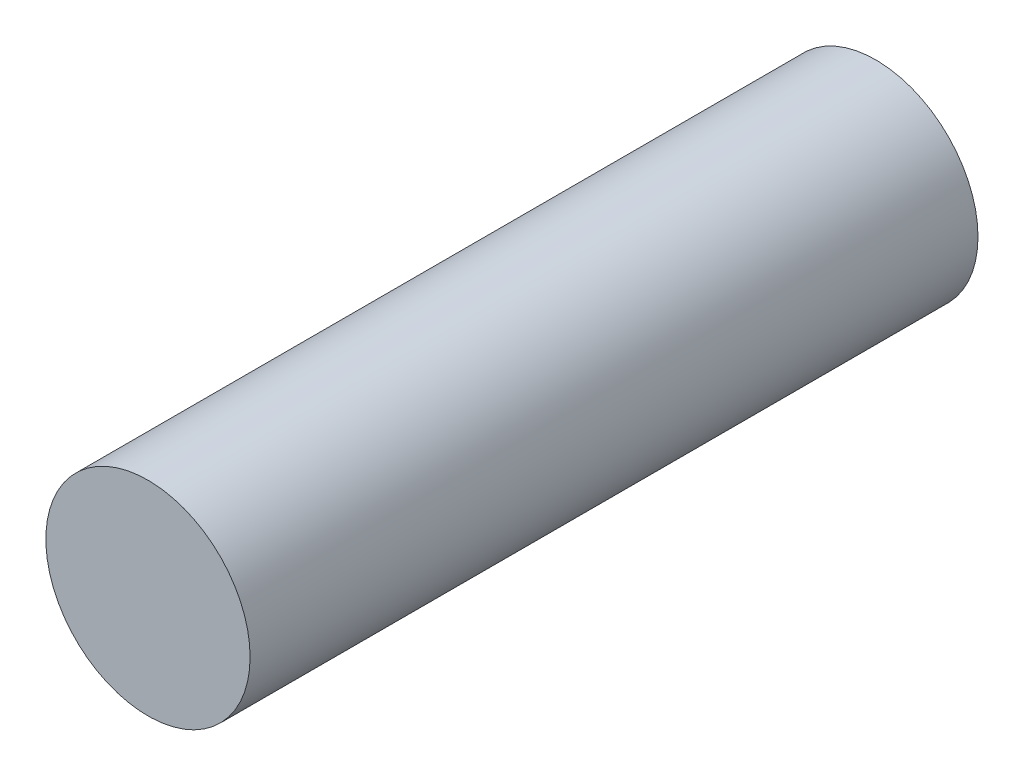
ISO-10303-21;
HEADER;
FILE_DESCRIPTION(('STEP AP214'),'2;1');
FILE_NAME('part.step','',(''),(''),'','','');
FILE_SCHEMA(('AUTOMOTIVE_DESIGN { 1 0 10303 214 1 1 1 1 }'));
ENDSEC;
DATA;
#1=APPLICATION_CONTEXT('core data for automotive mechanical design processes');
#2=APPLICATION_PROTOCOL_DEFINITION('international standard','automotive_design',2000,#1);
#3=PRODUCT_CONTEXT('',#1,'mechanical');
#4=PRODUCT('Part','Part','',(#3));
#5=PRODUCT_RELATED_PRODUCT_CATEGORY('part','',(#4));
#6=PRODUCT_DEFINITION_FORMATION('','',#4);
#7=PRODUCT_DEFINITION_CONTEXT('part definition',#1,'design');
#8=PRODUCT_DEFINITION('design','',#6,#7);
#9=PRODUCT_DEFINITION_SHAPE('','',#8);
#10=(LENGTH_UNIT() NAMED_UNIT(*) SI_UNIT(.MILLI.,.METRE.));
#11=(NAMED_UNIT(*) PLANE_ANGLE_UNIT() SI_UNIT($,.RADIAN.));
#12=(NAMED_UNIT(*) SI_UNIT($,.STERADIAN.) SOLID_ANGLE_UNIT());
#13=UNCERTAINTY_MEASURE_WITH_UNIT(LENGTH_MEASURE(1.E-05),#10,'distance_accuracy_value','');
#14=(GEOMETRIC_REPRESENTATION_CONTEXT(3) GLOBAL_UNCERTAINTY_ASSIGNED_CONTEXT((#13)) GLOBAL_UNIT_ASSIGNED_CONTEXT((#10,
#11,#12)) REPRESENTATION_CONTEXT('',''));
#15=CARTESIAN_POINT('',(0.,0.,0.));
#16=DIRECTION('',(0.,0.,1.));
#17=DIRECTION('',(1.,0.,0.));
#18=AXIS2_PLACEMENT_3D('',#15,#16,#17);
#19=CARTESIAN_POINT('',(0.,0.,9.8));
#20=DIRECTION('',(0.,0.,-1.));
#21=DIRECTION('',(-1.,0.,0.));
#22=AXIS2_PLACEMENT_3D('',#19,#20,#21);
#23=CYLINDRICAL_SURFACE('',#22,1.375);
#24=CARTESIAN_POINT('',(0.,0.,9.8));
#25=DIRECTION('',(0.,0.,1.));
#26=DIRECTION('',(1.,0.,0.));
#27=AXIS2_PLACEMENT_3D('',#24,#25,#26);
#28=CIRCLE('',#27,1.375);
#29=CARTESIAN_POINT('',(1.375,0.,9.8));
#30=VERTEX_POINT('',#29);
#31=EDGE_CURVE('E10',#30,#30,#28,.T.);
#32=ORIENTED_EDGE('',*,*,#31,.F.);
#33=EDGE_LOOP('',(#32));
#34=FACE_BOUND('',#33,.T.);
#35=CARTESIAN_POINT('',(0.,0.,0.));
#36=DIRECTION('',(0.,0.,1.));
#37=DIRECTION('',(1.,0.,0.));
#38=AXIS2_PLACEMENT_3D('',#35,#36,#37);
#39=CIRCLE('',#38,1.375);
#40=CARTESIAN_POINT('',(1.375,0.,0.));
#41=VERTEX_POINT('',#40);
#42=EDGE_CURVE('E43',#41,#41,#39,.T.);
#43=ORIENTED_EDGE('',*,*,#42,.T.);
#44=EDGE_LOOP('',(#43));
#45=FACE_BOUND('',#44,.T.);
#46=ADVANCED_FACE('F40',(#34,#45),#23,.T.);
#47=CARTESIAN_POINT('',(0.,0.,9.8));
#48=DIRECTION('',(0.,0.,1.));
#49=DIRECTION('',(1.,0.,0.));
#50=AXIS2_PLACEMENT_3D('',#47,#48,#49);
#51=PLANE('',#50);
#52=ORIENTED_EDGE('',*,*,#31,.T.);
#53=EDGE_LOOP('',(#52));
#54=FACE_BOUND('',#53,.T.);
#55=ADVANCED_FACE('F57',(#54),#51,.T.);
#56=CARTESIAN_POINT('',(0.,0.,0.));
#57=DIRECTION('',(0.,0.,1.));
#58=DIRECTION('',(1.,0.,0.));
#59=AXIS2_PLACEMENT_3D('',#56,#57,#58);
#60=PLANE('',#59);
#61=ORIENTED_EDGE('',*,*,#42,.F.);
#62=EDGE_LOOP('',(#61));
#63=FACE_BOUND('',#62,.T.);
#64=ADVANCED_FACE('F55',(#63),#60,.F.);
#65=CLOSED_SHELL('',(#46,#55,#64));
#66=MANIFOLD_SOLID_BREP('B2',#65);
#67=ADVANCED_BREP_SHAPE_REPRESENTATION('',(#18,#66),#14);
#68=SHAPE_DEFINITION_REPRESENTATION(#9,#67);
ENDSEC;
END-ISO-10303-21;
